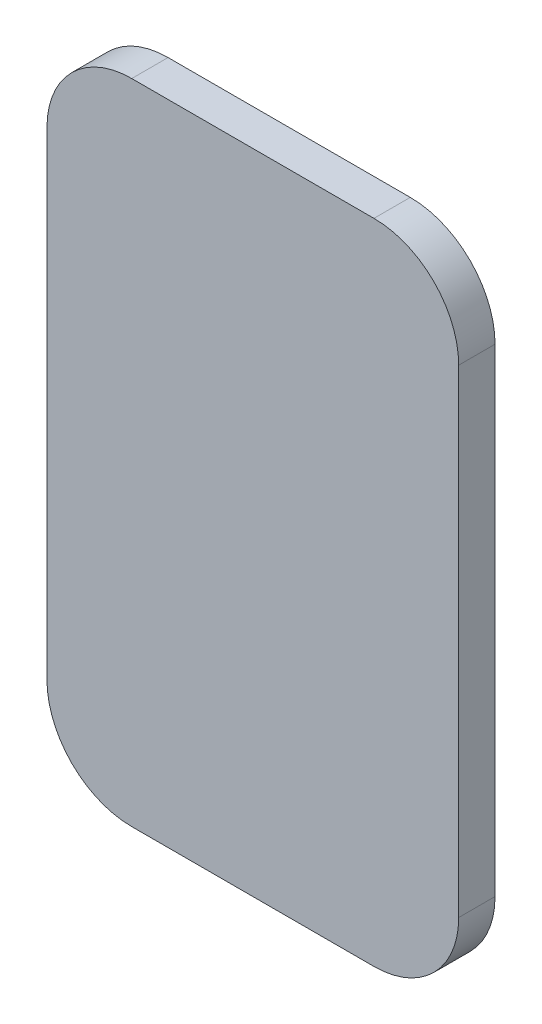
ISO-10303-21;
HEADER;
FILE_DESCRIPTION(('STEP AP214'),'2;1');
FILE_NAME('part.step','',(''),(''),'','','');
FILE_SCHEMA(('AUTOMOTIVE_DESIGN { 1 0 10303 214 1 1 1 1 }'));
ENDSEC;
DATA;
#1=APPLICATION_CONTEXT('core data for automotive mechanical design processes');
#2=APPLICATION_PROTOCOL_DEFINITION('international standard','automotive_design',2000,#1);
#3=PRODUCT_CONTEXT('',#1,'mechanical');
#4=PRODUCT('Part','Part','',(#3));
#5=PRODUCT_RELATED_PRODUCT_CATEGORY('part','',(#4));
#6=PRODUCT_DEFINITION_FORMATION('','',#4);
#7=PRODUCT_DEFINITION_CONTEXT('part definition',#1,'design');
#8=PRODUCT_DEFINITION('design','',#6,#7);
#9=PRODUCT_DEFINITION_SHAPE('','',#8);
#10=(LENGTH_UNIT() NAMED_UNIT(*) SI_UNIT(.MILLI.,.METRE.));
#11=(NAMED_UNIT(*) PLANE_ANGLE_UNIT() SI_UNIT($,.RADIAN.));
#12=(NAMED_UNIT(*) SI_UNIT($,.STERADIAN.) SOLID_ANGLE_UNIT());
#13=UNCERTAINTY_MEASURE_WITH_UNIT(LENGTH_MEASURE(1.E-05),#10,'distance_accuracy_value','');
#14=(GEOMETRIC_REPRESENTATION_CONTEXT(3) GLOBAL_UNCERTAINTY_ASSIGNED_CONTEXT((#13)) GLOBAL_UNIT_ASSIGNED_CONTEXT((#10,
#11,#12)) REPRESENTATION_CONTEXT('',''));
#15=CARTESIAN_POINT('',(0.,0.,0.));
#16=DIRECTION('',(0.,0.,1.));
#17=DIRECTION('',(1.,0.,0.));
#18=AXIS2_PLACEMENT_3D('',#15,#16,#17);
#19=CARTESIAN_POINT('',(-80.7,58.9850330229725,6.));
#20=DIRECTION('',(0.,0.,-1.));
#21=DIRECTION('',(-1.,0.,0.));
#22=AXIS2_PLACEMENT_3D('',#19,#20,#21);
#23=CYLINDRICAL_SURFACE('',#22,14.);
#24=CARTESIAN_POINT('',(-80.7,58.9850330229725,0.));
#25=DIRECTION('',(0.,0.,1.));
#26=DIRECTION('',(1.,0.,0.));
#27=AXIS2_PLACEMENT_3D('',#24,#25,#26);
#28=CIRCLE('',#27,14.);
#29=CARTESIAN_POINT('',(-80.7,72.9850330229725,0.));
#30=VERTEX_POINT('',#29);
#31=CARTESIAN_POINT('',(-94.7,58.9850330229725,0.));
#32=VERTEX_POINT('',#31);
#33=EDGE_CURVE('E131',#30,#32,#28,.T.);
#34=ORIENTED_EDGE('',*,*,#33,.T.);
#35=DIRECTION('',(0.,0.,-1.));
#36=VECTOR('',#35,1.);
#37=CARTESIAN_POINT('',(-94.7,58.9850330229725,6.));
#38=LINE('',#37,#36);
#39=CARTESIAN_POINT('',(-94.7,58.9850330229725,6.));
#40=VERTEX_POINT('',#39);
#41=EDGE_CURVE('E11',#40,#32,#38,.T.);
#42=ORIENTED_EDGE('',*,*,#41,.F.);
#43=CARTESIAN_POINT('',(-80.7,58.9850330229725,6.));
#44=DIRECTION('',(0.,0.,1.));
#45=DIRECTION('',(1.,0.,0.));
#46=AXIS2_PLACEMENT_3D('',#43,#44,#45);
#47=CIRCLE('',#46,14.);
#48=CARTESIAN_POINT('',(-80.7,72.9850330229725,6.));
#49=VERTEX_POINT('',#48);
#50=EDGE_CURVE('E145',#49,#40,#47,.T.);
#51=ORIENTED_EDGE('',*,*,#50,.F.);
#52=DIRECTION('',(0.,0.,-1.));
#53=VECTOR('',#52,1.);
#54=CARTESIAN_POINT('',(-80.7,72.9850330229725,6.));
#55=LINE('',#54,#53);
#56=EDGE_CURVE('E127',#49,#30,#55,.T.);
#57=ORIENTED_EDGE('',*,*,#56,.T.);
#58=EDGE_LOOP('',(#34,#42,#51,#57));
#59=FACE_BOUND('',#58,.T.);
#60=ADVANCED_FACE('F35',(#59),#23,.T.);
#61=CARTESIAN_POINT('',(-94.7,58.9850330229725,6.));
#62=DIRECTION('',(1.,0.,0.));
#63=DIRECTION('',(0.,1.,0.));
#64=AXIS2_PLACEMENT_3D('',#61,#62,#63);
#65=PLANE('',#64);
#66=DIRECTION('',(0.,-1.,0.));
#67=VECTOR('',#66,1.);
#68=CARTESIAN_POINT('',(-94.7,58.9850330229725,0.));
#69=LINE('',#68,#67);
#70=CARTESIAN_POINT('',(-94.7,-20.0149669770275,0.));
#71=VERTEX_POINT('',#70);
#72=EDGE_CURVE('E134',#32,#71,#69,.T.);
#73=ORIENTED_EDGE('',*,*,#72,.T.);
#74=DIRECTION('',(0.,0.,-1.));
#75=VECTOR('',#74,1.);
#76=CARTESIAN_POINT('',(-94.7,-20.0149669770275,6.));
#77=LINE('',#76,#75);
#78=CARTESIAN_POINT('',(-94.7,-20.0149669770275,6.));
#79=VERTEX_POINT('',#78);
#80=EDGE_CURVE('E43',#79,#71,#77,.T.);
#81=ORIENTED_EDGE('',*,*,#80,.F.);
#82=DIRECTION('',(0.,-1.,0.));
#83=VECTOR('',#82,1.);
#84=CARTESIAN_POINT('',(-94.7,58.9850330229725,6.));
#85=LINE('',#84,#83);
#86=EDGE_CURVE('E94',#40,#79,#85,.T.);
#87=ORIENTED_EDGE('',*,*,#86,.F.);
#88=ORIENTED_EDGE('',*,*,#41,.T.);
#89=EDGE_LOOP('',(#73,#81,#87,#88));
#90=FACE_BOUND('',#89,.T.);
#91=ADVANCED_FACE('F180',(#90),#65,.F.);
#92=CARTESIAN_POINT('',(-80.7,-20.0149669770275,6.));
#93=DIRECTION('',(0.,0.,-1.));
#94=DIRECTION('',(-1.,0.,0.));
#95=AXIS2_PLACEMENT_3D('',#92,#93,#94);
#96=CYLINDRICAL_SURFACE('',#95,14.);
#97=CARTESIAN_POINT('',(-80.7,-20.0149669770275,0.));
#98=DIRECTION('',(0.,0.,1.));
#99=DIRECTION('',(1.,0.,0.));
#100=AXIS2_PLACEMENT_3D('',#97,#98,#99);
#101=CIRCLE('',#100,14.);
#102=CARTESIAN_POINT('',(-80.7,-34.0149669770275,0.));
#103=VERTEX_POINT('',#102);
#104=EDGE_CURVE('E136',#71,#103,#101,.T.);
#105=ORIENTED_EDGE('',*,*,#104,.T.);
#106=DIRECTION('',(0.,0.,-1.));
#107=VECTOR('',#106,1.);
#108=CARTESIAN_POINT('',(-80.7,-34.0149669770275,6.));
#109=LINE('',#108,#107);
#110=CARTESIAN_POINT('',(-80.7,-34.0149669770275,6.));
#111=VERTEX_POINT('',#110);
#112=EDGE_CURVE('E152',#111,#103,#109,.T.);
#113=ORIENTED_EDGE('',*,*,#112,.F.);
#114=CARTESIAN_POINT('',(-80.7,-20.0149669770275,6.));
#115=DIRECTION('',(0.,0.,1.));
#116=DIRECTION('',(1.,0.,0.));
#117=AXIS2_PLACEMENT_3D('',#114,#115,#116);
#118=CIRCLE('',#117,14.);
#119=EDGE_CURVE('E160',#79,#111,#118,.T.);
#120=ORIENTED_EDGE('',*,*,#119,.F.);
#121=ORIENTED_EDGE('',*,*,#80,.T.);
#122=EDGE_LOOP('',(#105,#113,#120,#121));
#123=FACE_BOUND('',#122,.T.);
#124=ADVANCED_FACE('F158',(#123),#96,.T.);
#125=CARTESIAN_POINT('',(-80.7,-34.0149669770275,6.));
#126=DIRECTION('',(0.,1.,0.));
#127=DIRECTION('',(-1.,0.,0.));
#128=AXIS2_PLACEMENT_3D('',#125,#126,#127);
#129=PLANE('',#128);
#130=DIRECTION('',(1.,0.,0.));
#131=VECTOR('',#130,1.);
#132=CARTESIAN_POINT('',(-80.7,-34.0149669770275,0.));
#133=LINE('',#132,#131);
#134=CARTESIAN_POINT('',(-40.7,-34.0149669770275,0.));
#135=VERTEX_POINT('',#134);
#136=EDGE_CURVE('E138',#103,#135,#133,.T.);
#137=ORIENTED_EDGE('',*,*,#136,.T.);
#138=DIRECTION('',(0.,0.,-1.));
#139=VECTOR('',#138,1.);
#140=CARTESIAN_POINT('',(-40.7,-34.0149669770275,6.));
#141=LINE('',#140,#139);
#142=CARTESIAN_POINT('',(-40.7,-34.0149669770275,6.));
#143=VERTEX_POINT('',#142);
#144=EDGE_CURVE('E149',#143,#135,#141,.T.);
#145=ORIENTED_EDGE('',*,*,#144,.F.);
#146=DIRECTION('',(1.,0.,0.));
#147=VECTOR('',#146,1.);
#148=CARTESIAN_POINT('',(-80.7,-34.0149669770275,6.));
#149=LINE('',#148,#147);
#150=EDGE_CURVE('E172',#111,#143,#149,.T.);
#151=ORIENTED_EDGE('',*,*,#150,.F.);
#152=ORIENTED_EDGE('',*,*,#112,.T.);
#153=EDGE_LOOP('',(#137,#145,#151,#152));
#154=FACE_BOUND('',#153,.T.);
#155=ADVANCED_FACE('F168',(#154),#129,.F.);
#156=CARTESIAN_POINT('',(-40.7,-20.0149669770275,6.));
#157=DIRECTION('',(0.,0.,-1.));
#158=DIRECTION('',(-1.,0.,0.));
#159=AXIS2_PLACEMENT_3D('',#156,#157,#158);
#160=CYLINDRICAL_SURFACE('',#159,14.);
#161=CARTESIAN_POINT('',(-40.7,-20.0149669770275,0.));
#162=DIRECTION('',(0.,0.,1.));
#163=DIRECTION('',(1.,0.,0.));
#164=AXIS2_PLACEMENT_3D('',#161,#162,#163);
#165=CIRCLE('',#164,14.);
#166=CARTESIAN_POINT('',(-26.7,-20.0149669770275,0.));
#167=VERTEX_POINT('',#166);
#168=EDGE_CURVE('E140',#135,#167,#165,.T.);
#169=ORIENTED_EDGE('',*,*,#168,.T.);
#170=DIRECTION('',(0.,0.,-1.));
#171=VECTOR('',#170,1.);
#172=CARTESIAN_POINT('',(-26.7,-20.0149669770275,6.));
#173=LINE('',#172,#171);
#174=CARTESIAN_POINT('',(-26.7,-20.0149669770275,6.));
#175=VERTEX_POINT('',#174);
#176=EDGE_CURVE('E122',#175,#167,#173,.T.);
#177=ORIENTED_EDGE('',*,*,#176,.F.);
#178=CARTESIAN_POINT('',(-40.7,-20.0149669770275,6.));
#179=DIRECTION('',(0.,0.,1.));
#180=DIRECTION('',(1.,0.,0.));
#181=AXIS2_PLACEMENT_3D('',#178,#179,#180);
#182=CIRCLE('',#181,14.);
#183=EDGE_CURVE('E113',#143,#175,#182,.T.);
#184=ORIENTED_EDGE('',*,*,#183,.F.);
#185=ORIENTED_EDGE('',*,*,#144,.T.);
#186=EDGE_LOOP('',(#169,#177,#184,#185));
#187=FACE_BOUND('',#186,.T.);
#188=ADVANCED_FACE('F171',(#187),#160,.T.);
#189=CARTESIAN_POINT('',(-26.7,-20.0149669770275,6.));
#190=DIRECTION('',(-1.,0.,0.));
#191=DIRECTION('',(0.,-1.,0.));
#192=AXIS2_PLACEMENT_3D('',#189,#190,#191);
#193=PLANE('',#192);
#194=DIRECTION('',(0.,1.,0.));
#195=VECTOR('',#194,1.);
#196=CARTESIAN_POINT('',(-26.7,-20.0149669770275,0.));
#197=LINE('',#196,#195);
#198=CARTESIAN_POINT('',(-26.7,58.9850330229725,0.));
#199=VERTEX_POINT('',#198);
#200=EDGE_CURVE('E121',#167,#199,#197,.T.);
#201=ORIENTED_EDGE('',*,*,#200,.T.);
#202=DIRECTION('',(0.,0.,-1.));
#203=VECTOR('',#202,1.);
#204=CARTESIAN_POINT('',(-26.7,58.9850330229725,6.));
#205=LINE('',#204,#203);
#206=CARTESIAN_POINT('',(-26.7,58.9850330229725,6.));
#207=VERTEX_POINT('',#206);
#208=EDGE_CURVE('E118',#207,#199,#205,.T.);
#209=ORIENTED_EDGE('',*,*,#208,.F.);
#210=DIRECTION('',(0.,1.,0.));
#211=VECTOR('',#210,1.);
#212=CARTESIAN_POINT('',(-26.7,-20.0149669770275,6.));
#213=LINE('',#212,#211);
#214=EDGE_CURVE('E107',#175,#207,#213,.T.);
#215=ORIENTED_EDGE('',*,*,#214,.F.);
#216=ORIENTED_EDGE('',*,*,#176,.T.);
#217=EDGE_LOOP('',(#201,#209,#215,#216));
#218=FACE_BOUND('',#217,.T.);
#219=ADVANCED_FACE('F119',(#218),#193,.F.);
#220=CARTESIAN_POINT('',(-40.7,58.9850330229725,6.));
#221=DIRECTION('',(0.,0.,-1.));
#222=DIRECTION('',(-1.,0.,0.));
#223=AXIS2_PLACEMENT_3D('',#220,#221,#222);
#224=CYLINDRICAL_SURFACE('',#223,14.);
#225=CARTESIAN_POINT('',(-40.7,58.9850330229725,0.));
#226=DIRECTION('',(0.,0.,1.));
#227=DIRECTION('',(1.,0.,0.));
#228=AXIS2_PLACEMENT_3D('',#225,#226,#227);
#229=CIRCLE('',#228,14.);
#230=CARTESIAN_POINT('',(-40.7,72.9850330229725,0.));
#231=VERTEX_POINT('',#230);
#232=EDGE_CURVE('E80',#199,#231,#229,.T.);
#233=ORIENTED_EDGE('',*,*,#232,.T.);
#234=DIRECTION('',(0.,0.,-1.));
#235=VECTOR('',#234,1.);
#236=CARTESIAN_POINT('',(-40.7,72.9850330229725,6.));
#237=LINE('',#236,#235);
#238=CARTESIAN_POINT('',(-40.7,72.9850330229725,6.));
#239=VERTEX_POINT('',#238);
#240=EDGE_CURVE('E123',#239,#231,#237,.T.);
#241=ORIENTED_EDGE('',*,*,#240,.F.);
#242=CARTESIAN_POINT('',(-40.7,58.9850330229725,6.));
#243=DIRECTION('',(0.,0.,1.));
#244=DIRECTION('',(1.,0.,0.));
#245=AXIS2_PLACEMENT_3D('',#242,#243,#244);
#246=CIRCLE('',#245,14.);
#247=EDGE_CURVE('E111',#207,#239,#246,.T.);
#248=ORIENTED_EDGE('',*,*,#247,.F.);
#249=ORIENTED_EDGE('',*,*,#208,.T.);
#250=EDGE_LOOP('',(#233,#241,#248,#249));
#251=FACE_BOUND('',#250,.T.);
#252=ADVANCED_FACE('F125',(#251),#224,.T.);
#253=CARTESIAN_POINT('',(-40.7,72.9850330229725,6.));
#254=DIRECTION('',(0.,-1.,0.));
#255=DIRECTION('',(0.,0.,-1.));
#256=AXIS2_PLACEMENT_3D('',#253,#254,#255);
#257=PLANE('',#256);
#258=DIRECTION('',(-1.,0.,0.));
#259=VECTOR('',#258,1.);
#260=CARTESIAN_POINT('',(-40.7,72.9850330229725,0.));
#261=LINE('',#260,#259);
#262=EDGE_CURVE('E86',#231,#30,#261,.T.);
#263=ORIENTED_EDGE('',*,*,#262,.T.);
#264=ORIENTED_EDGE('',*,*,#56,.F.);
#265=DIRECTION('',(-1.,0.,0.));
#266=VECTOR('',#265,1.);
#267=CARTESIAN_POINT('',(-40.7,72.9850330229725,6.));
#268=LINE('',#267,#266);
#269=EDGE_CURVE('E51',#239,#49,#268,.T.);
#270=ORIENTED_EDGE('',*,*,#269,.F.);
#271=ORIENTED_EDGE('',*,*,#240,.T.);
#272=EDGE_LOOP('',(#263,#264,#270,#271));
#273=FACE_BOUND('',#272,.T.);
#274=ADVANCED_FACE('F196',(#273),#257,.F.);
#275=CARTESIAN_POINT('',(-80.7,58.9850330229725,6.));
#276=DIRECTION('',(0.,0.,1.));
#277=DIRECTION('',(1.,0.,0.));
#278=AXIS2_PLACEMENT_3D('',#275,#276,#277);
#279=PLANE('',#278);
#280=ORIENTED_EDGE('',*,*,#50,.T.);
#281=ORIENTED_EDGE('',*,*,#86,.T.);
#282=ORIENTED_EDGE('',*,*,#119,.T.);
#283=ORIENTED_EDGE('',*,*,#150,.T.);
#284=ORIENTED_EDGE('',*,*,#183,.T.);
#285=ORIENTED_EDGE('',*,*,#214,.T.);
#286=ORIENTED_EDGE('',*,*,#247,.T.);
#287=ORIENTED_EDGE('',*,*,#269,.T.);
#288=EDGE_LOOP('',(#280,#281,#282,#283,#284,#285,#286,#287));
#289=FACE_BOUND('',#288,.T.);
#290=ADVANCED_FACE('F109',(#289),#279,.T.);
#291=CARTESIAN_POINT('',(-80.7,58.9850330229725,0.));
#292=DIRECTION('',(0.,0.,1.));
#293=DIRECTION('',(1.,0.,0.));
#294=AXIS2_PLACEMENT_3D('',#291,#292,#293);
#295=PLANE('',#294);
#296=ORIENTED_EDGE('',*,*,#33,.F.);
#297=ORIENTED_EDGE('',*,*,#262,.F.);
#298=ORIENTED_EDGE('',*,*,#232,.F.);
#299=ORIENTED_EDGE('',*,*,#200,.F.);
#300=ORIENTED_EDGE('',*,*,#168,.F.);
#301=ORIENTED_EDGE('',*,*,#136,.F.);
#302=ORIENTED_EDGE('',*,*,#104,.F.);
#303=ORIENTED_EDGE('',*,*,#72,.F.);
#304=EDGE_LOOP('',(#296,#297,#298,#299,#300,#301,#302,#303));
#305=FACE_BOUND('',#304,.T.);
#306=ADVANCED_FACE('F164',(#305),#295,.F.);
#307=CLOSED_SHELL('',(#60,#91,#124,#155,#188,#219,#252,#274,#290,#306));
#308=MANIFOLD_SOLID_BREP('B2',#307);
#309=ADVANCED_BREP_SHAPE_REPRESENTATION('',(#18,#308),#14);
#310=SHAPE_DEFINITION_REPRESENTATION(#9,#309);
ENDSEC;
END-ISO-10303-21;
